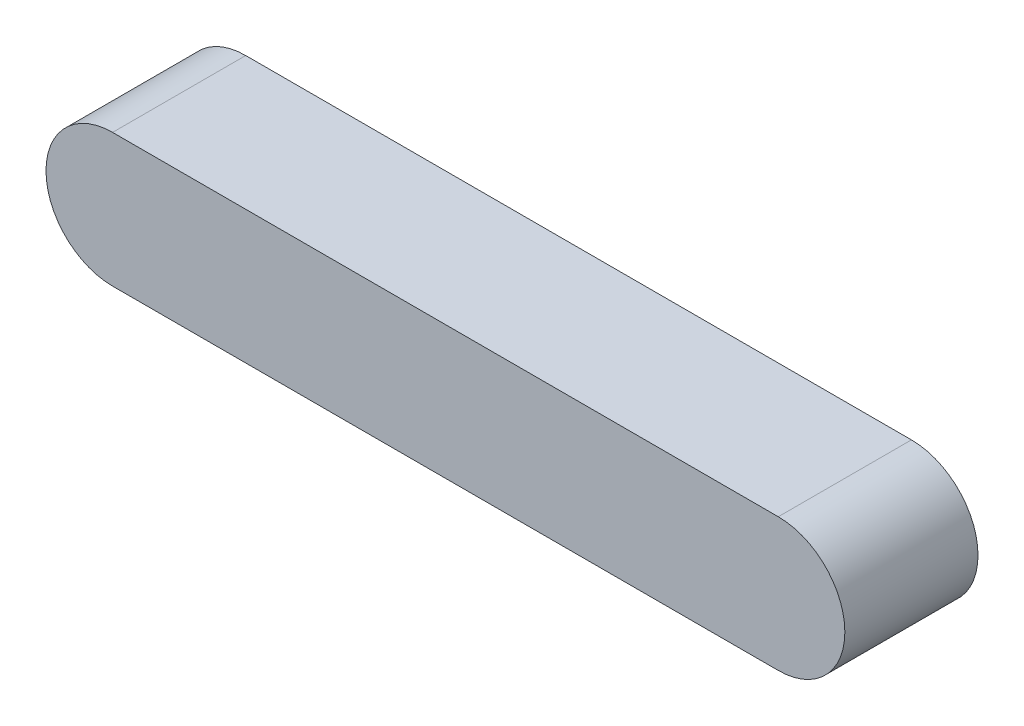
ISO-10303-21;
HEADER;
FILE_DESCRIPTION(('STEP AP214'),'2;1');
FILE_NAME('part.step','',(''),(''),'','','');
FILE_SCHEMA(('AUTOMOTIVE_DESIGN { 1 0 10303 214 1 1 1 1 }'));
ENDSEC;
DATA;
#1=APPLICATION_CONTEXT('core data for automotive mechanical design processes');
#2=APPLICATION_PROTOCOL_DEFINITION('international standard','automotive_design',2000,#1);
#3=PRODUCT_CONTEXT('',#1,'mechanical');
#4=PRODUCT('Part','Part','',(#3));
#5=PRODUCT_RELATED_PRODUCT_CATEGORY('part','',(#4));
#6=PRODUCT_DEFINITION_FORMATION('','',#4);
#7=PRODUCT_DEFINITION_CONTEXT('part definition',#1,'design');
#8=PRODUCT_DEFINITION('design','',#6,#7);
#9=PRODUCT_DEFINITION_SHAPE('','',#8);
#10=(LENGTH_UNIT() NAMED_UNIT(*) SI_UNIT(.MILLI.,.METRE.));
#11=(NAMED_UNIT(*) PLANE_ANGLE_UNIT() SI_UNIT($,.RADIAN.));
#12=(NAMED_UNIT(*) SI_UNIT($,.STERADIAN.) SOLID_ANGLE_UNIT());
#13=UNCERTAINTY_MEASURE_WITH_UNIT(LENGTH_MEASURE(1.E-05),#10,'distance_accuracy_value','');
#14=(GEOMETRIC_REPRESENTATION_CONTEXT(3) GLOBAL_UNCERTAINTY_ASSIGNED_CONTEXT((#13)) GLOBAL_UNIT_ASSIGNED_CONTEXT((#10,
#11,#12)) REPRESENTATION_CONTEXT('',''));
#15=CARTESIAN_POINT('',(0.,0.,0.));
#16=DIRECTION('',(0.,0.,1.));
#17=DIRECTION('',(1.,0.,0.));
#18=AXIS2_PLACEMENT_3D('',#15,#16,#17);
#19=CARTESIAN_POINT('',(-127.,0.,50.8));
#20=DIRECTION('',(0.,0.,-1.));
#21=DIRECTION('',(-1.,0.,0.));
#22=AXIS2_PLACEMENT_3D('',#19,#20,#21);
#23=CYLINDRICAL_SURFACE('',#22,25.4);
#24=CARTESIAN_POINT('',(-127.,0.,0.));
#25=DIRECTION('',(0.,0.,1.));
#26=DIRECTION('',(1.,0.,0.));
#27=AXIS2_PLACEMENT_3D('',#24,#25,#26);
#28=CIRCLE('',#27,25.4);
#29=CARTESIAN_POINT('',(-127.,25.4,0.));
#30=VERTEX_POINT('',#29);
#31=CARTESIAN_POINT('',(-127.,-25.4,0.));
#32=VERTEX_POINT('',#31);
#33=EDGE_CURVE('E96',#30,#32,#28,.T.);
#34=ORIENTED_EDGE('',*,*,#33,.T.);
#35=DIRECTION('',(0.,0.,-1.));
#36=VECTOR('',#35,1.);
#37=CARTESIAN_POINT('',(-127.,-25.4,50.8));
#38=LINE('',#37,#36);
#39=CARTESIAN_POINT('',(-127.,-25.4,50.8));
#40=VERTEX_POINT('',#39);
#41=EDGE_CURVE('E11',#40,#32,#38,.T.);
#42=ORIENTED_EDGE('',*,*,#41,.F.);
#43=CARTESIAN_POINT('',(-127.,0.,50.8));
#44=DIRECTION('',(0.,0.,1.));
#45=DIRECTION('',(1.,0.,0.));
#46=AXIS2_PLACEMENT_3D('',#43,#44,#45);
#47=CIRCLE('',#46,25.4);
#48=CARTESIAN_POINT('',(-127.,25.4,50.8));
#49=VERTEX_POINT('',#48);
#50=EDGE_CURVE('E84',#49,#40,#47,.T.);
#51=ORIENTED_EDGE('',*,*,#50,.F.);
#52=DIRECTION('',(0.,0.,-1.));
#53=VECTOR('',#52,1.);
#54=CARTESIAN_POINT('',(-127.,25.4,50.8));
#55=LINE('',#54,#53);
#56=EDGE_CURVE('E92',#49,#30,#55,.T.);
#57=ORIENTED_EDGE('',*,*,#56,.T.);
#58=EDGE_LOOP('',(#34,#42,#51,#57));
#59=FACE_BOUND('',#58,.T.);
#60=ADVANCED_FACE('F33',(#59),#23,.T.);
#61=CARTESIAN_POINT('',(-127.,-25.4,50.8));
#62=DIRECTION('',(0.,1.,0.));
#63=DIRECTION('',(-1.,0.,0.));
#64=AXIS2_PLACEMENT_3D('',#61,#62,#63);
#65=PLANE('',#64);
#66=DIRECTION('',(1.,0.,0.));
#67=VECTOR('',#66,1.);
#68=CARTESIAN_POINT('',(-127.,-25.4,0.));
#69=LINE('',#68,#67);
#70=CARTESIAN_POINT('',(127.,-25.4,0.));
#71=VERTEX_POINT('',#70);
#72=EDGE_CURVE('E88',#32,#71,#69,.T.);
#73=ORIENTED_EDGE('',*,*,#72,.T.);
#74=DIRECTION('',(0.,0.,-1.));
#75=VECTOR('',#74,1.);
#76=CARTESIAN_POINT('',(127.,-25.4,50.8));
#77=LINE('',#76,#75);
#78=CARTESIAN_POINT('',(127.,-25.4,50.8));
#79=VERTEX_POINT('',#78);
#80=EDGE_CURVE('E41',#79,#71,#77,.T.);
#81=ORIENTED_EDGE('',*,*,#80,.F.);
#82=DIRECTION('',(1.,0.,0.));
#83=VECTOR('',#82,1.);
#84=CARTESIAN_POINT('',(-127.,-25.4,50.8));
#85=LINE('',#84,#83);
#86=EDGE_CURVE('E79',#40,#79,#85,.T.);
#87=ORIENTED_EDGE('',*,*,#86,.F.);
#88=ORIENTED_EDGE('',*,*,#41,.T.);
#89=EDGE_LOOP('',(#73,#81,#87,#88));
#90=FACE_BOUND('',#89,.T.);
#91=ADVANCED_FACE('F87',(#90),#65,.F.);
#92=CARTESIAN_POINT('',(127.,0.,50.8));
#93=DIRECTION('',(0.,0.,-1.));
#94=DIRECTION('',(-1.,0.,0.));
#95=AXIS2_PLACEMENT_3D('',#92,#93,#94);
#96=CYLINDRICAL_SURFACE('',#95,25.4);
#97=CARTESIAN_POINT('',(127.,0.,0.));
#98=DIRECTION('',(0.,0.,1.));
#99=DIRECTION('',(1.,0.,0.));
#100=AXIS2_PLACEMENT_3D('',#97,#98,#99);
#101=CIRCLE('',#100,25.4);
#102=CARTESIAN_POINT('',(127.,25.4,0.));
#103=VERTEX_POINT('',#102);
#104=EDGE_CURVE('E66',#71,#103,#101,.T.);
#105=ORIENTED_EDGE('',*,*,#104,.T.);
#106=DIRECTION('',(0.,0.,-1.));
#107=VECTOR('',#106,1.);
#108=CARTESIAN_POINT('',(127.,25.4,50.8));
#109=LINE('',#108,#107);
#110=CARTESIAN_POINT('',(127.,25.4,50.8));
#111=VERTEX_POINT('',#110);
#112=EDGE_CURVE('E89',#111,#103,#109,.T.);
#113=ORIENTED_EDGE('',*,*,#112,.F.);
#114=CARTESIAN_POINT('',(127.,0.,50.8));
#115=DIRECTION('',(0.,0.,1.));
#116=DIRECTION('',(1.,0.,0.));
#117=AXIS2_PLACEMENT_3D('',#114,#115,#116);
#118=CIRCLE('',#117,25.4);
#119=EDGE_CURVE('E82',#79,#111,#118,.T.);
#120=ORIENTED_EDGE('',*,*,#119,.F.);
#121=ORIENTED_EDGE('',*,*,#80,.T.);
#122=EDGE_LOOP('',(#105,#113,#120,#121));
#123=FACE_BOUND('',#122,.T.);
#124=ADVANCED_FACE('F90',(#123),#96,.T.);
#125=CARTESIAN_POINT('',(-127.,25.4,50.8));
#126=DIRECTION('',(0.,-1.,0.));
#127=DIRECTION('',(1.,0.,0.));
#128=AXIS2_PLACEMENT_3D('',#125,#126,#127);
#129=PLANE('',#128);
#130=DIRECTION('',(-1.,0.,0.));
#131=VECTOR('',#130,1.);
#132=CARTESIAN_POINT('',(-127.,25.4,0.));
#133=LINE('',#132,#131);
#134=EDGE_CURVE('E72',#103,#30,#133,.T.);
#135=ORIENTED_EDGE('',*,*,#134,.T.);
#136=ORIENTED_EDGE('',*,*,#56,.F.);
#137=DIRECTION('',(-1.,0.,0.));
#138=VECTOR('',#137,1.);
#139=CARTESIAN_POINT('',(-127.,25.4,50.8));
#140=LINE('',#139,#138);
#141=EDGE_CURVE('E49',#111,#49,#140,.T.);
#142=ORIENTED_EDGE('',*,*,#141,.F.);
#143=ORIENTED_EDGE('',*,*,#112,.T.);
#144=EDGE_LOOP('',(#135,#136,#142,#143));
#145=FACE_BOUND('',#144,.T.);
#146=ADVANCED_FACE('F103',(#145),#129,.F.);
#147=CARTESIAN_POINT('',(-127.,0.,50.8));
#148=DIRECTION('',(0.,0.,1.));
#149=DIRECTION('',(1.,0.,0.));
#150=AXIS2_PLACEMENT_3D('',#147,#148,#149);
#151=PLANE('',#150);
#152=ORIENTED_EDGE('',*,*,#50,.T.);
#153=ORIENTED_EDGE('',*,*,#86,.T.);
#154=ORIENTED_EDGE('',*,*,#119,.T.);
#155=ORIENTED_EDGE('',*,*,#141,.T.);
#156=EDGE_LOOP('',(#152,#153,#154,#155));
#157=FACE_BOUND('',#156,.T.);
#158=ADVANCED_FACE('F80',(#157),#151,.T.);
#159=CARTESIAN_POINT('',(-127.,0.,0.));
#160=DIRECTION('',(0.,0.,1.));
#161=DIRECTION('',(1.,0.,0.));
#162=AXIS2_PLACEMENT_3D('',#159,#160,#161);
#163=PLANE('',#162);
#164=ORIENTED_EDGE('',*,*,#33,.F.);
#165=ORIENTED_EDGE('',*,*,#134,.F.);
#166=ORIENTED_EDGE('',*,*,#104,.F.);
#167=ORIENTED_EDGE('',*,*,#72,.F.);
#168=EDGE_LOOP('',(#164,#165,#166,#167));
#169=FACE_BOUND('',#168,.T.);
#170=ADVANCED_FACE('F106',(#169),#163,.F.);
#171=CLOSED_SHELL('',(#60,#91,#124,#146,#158,#170));
#172=MANIFOLD_SOLID_BREP('B2',#171);
#173=ADVANCED_BREP_SHAPE_REPRESENTATION('',(#18,#172),#14);
#174=SHAPE_DEFINITION_REPRESENTATION(#9,#173);
ENDSEC;
END-ISO-10303-21;
